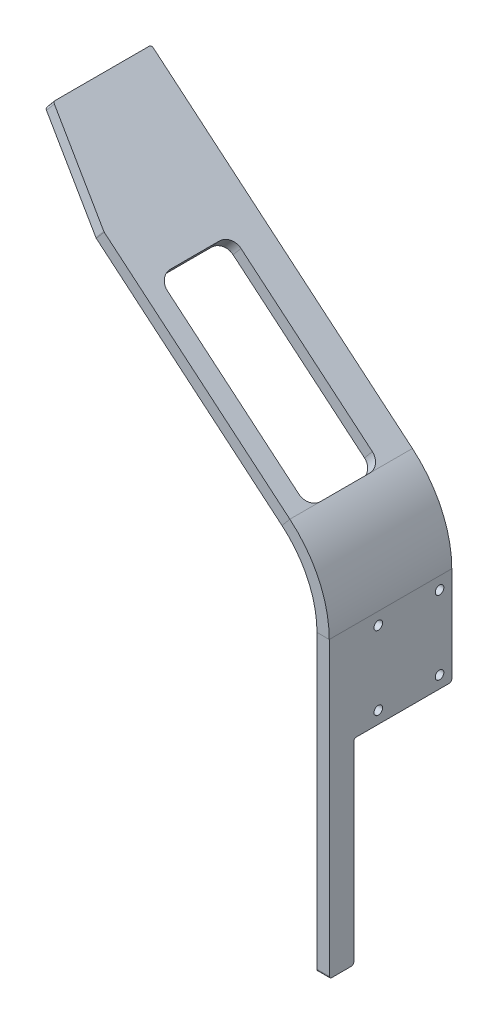
ISO-10303-21;
HEADER;
FILE_DESCRIPTION(('STEP AP214'),'2;1');
FILE_NAME('part.step','',(''),(''),'','','');
FILE_SCHEMA(('AUTOMOTIVE_DESIGN { 1 0 10303 214 1 1 1 1 }'));
ENDSEC;
DATA;
#1=APPLICATION_CONTEXT('core data for automotive mechanical design processes');
#2=APPLICATION_PROTOCOL_DEFINITION('international standard','automotive_design',2000,#1);
#3=PRODUCT_CONTEXT('',#1,'mechanical');
#4=PRODUCT('Part','Part','',(#3));
#5=PRODUCT_RELATED_PRODUCT_CATEGORY('part','',(#4));
#6=PRODUCT_DEFINITION_FORMATION('','',#4);
#7=PRODUCT_DEFINITION_CONTEXT('part definition',#1,'design');
#8=PRODUCT_DEFINITION('design','',#6,#7);
#9=PRODUCT_DEFINITION_SHAPE('','',#8);
#10=(LENGTH_UNIT() NAMED_UNIT(*) SI_UNIT(.MILLI.,.METRE.));
#11=(NAMED_UNIT(*) PLANE_ANGLE_UNIT() SI_UNIT($,.RADIAN.));
#12=(NAMED_UNIT(*) SI_UNIT($,.STERADIAN.) SOLID_ANGLE_UNIT());
#13=UNCERTAINTY_MEASURE_WITH_UNIT(LENGTH_MEASURE(1.E-05),#10,'distance_accuracy_value','');
#14=(GEOMETRIC_REPRESENTATION_CONTEXT(3) GLOBAL_UNCERTAINTY_ASSIGNED_CONTEXT((#13)) GLOBAL_UNIT_ASSIGNED_CONTEXT((#10,
#11,#12)) REPRESENTATION_CONTEXT('',''));
#15=CARTESIAN_POINT('',(0.,0.,0.));
#16=DIRECTION('',(0.,0.,1.));
#17=DIRECTION('',(1.,0.,0.));
#18=AXIS2_PLACEMENT_3D('',#15,#16,#17);
#19=CARTESIAN_POINT('',(5.,0.,50.));
#20=DIRECTION('',(-1.,0.,0.));
#21=DIRECTION('',(0.,0.,1.));
#22=AXIS2_PLACEMENT_3D('',#19,#20,#21);
#23=PLANE('',#22);
#24=CARTESIAN_POINT('',(5.,145.,30.));
#25=DIRECTION('',(-1.,0.,0.));
#26=DIRECTION('',(0.,0.,1.));
#27=AXIS2_PLACEMENT_3D('',#24,#25,#26);
#28=CIRCLE('',#27,1.75000000000001);
#29=CARTESIAN_POINT('',(5.,145.,31.75));
#30=VERTEX_POINT('',#29);
#31=EDGE_CURVE('E497',#30,#30,#28,.T.);
#32=ORIENTED_EDGE('',*,*,#31,.T.);
#33=EDGE_LOOP('',(#32));
#34=FACE_BOUND('',#33,.T.);
#35=CARTESIAN_POINT('',(5.,145.,5.));
#36=DIRECTION('',(-1.,0.,0.));
#37=DIRECTION('',(0.,0.,1.));
#38=AXIS2_PLACEMENT_3D('',#35,#36,#37);
#39=CIRCLE('',#38,1.75);
#40=CARTESIAN_POINT('',(5.,145.,6.75));
#41=VERTEX_POINT('',#40);
#42=EDGE_CURVE('E494',#41,#41,#39,.T.);
#43=ORIENTED_EDGE('',*,*,#42,.T.);
#44=EDGE_LOOP('',(#43));
#45=FACE_BOUND('',#44,.T.);
#46=CARTESIAN_POINT('',(5.,115.,5.));
#47=DIRECTION('',(-1.,0.,0.));
#48=DIRECTION('',(0.,0.,1.));
#49=AXIS2_PLACEMENT_3D('',#46,#47,#48);
#50=CIRCLE('',#49,1.75);
#51=CARTESIAN_POINT('',(5.,115.,6.75));
#52=VERTEX_POINT('',#51);
#53=EDGE_CURVE('E491',#52,#52,#50,.T.);
#54=ORIENTED_EDGE('',*,*,#53,.T.);
#55=EDGE_LOOP('',(#54));
#56=FACE_BOUND('',#55,.T.);
#57=CARTESIAN_POINT('',(5.,115.,30.));
#58=DIRECTION('',(-1.,0.,0.));
#59=DIRECTION('',(0.,0.,1.));
#60=AXIS2_PLACEMENT_3D('',#57,#58,#59);
#61=CIRCLE('',#60,1.75000000000001);
#62=CARTESIAN_POINT('',(5.,115.,31.75));
#63=VERTEX_POINT('',#62);
#64=EDGE_CURVE('E488',#63,#63,#61,.T.);
#65=ORIENTED_EDGE('',*,*,#64,.T.);
#66=EDGE_LOOP('',(#65));
#67=FACE_BOUND('',#66,.T.);
#68=DIRECTION('',(0.,0.,1.));
#69=VECTOR('',#68,1.);
#70=CARTESIAN_POINT('',(5.,110.,0.));
#71=LINE('',#70,#69);
#72=CARTESIAN_POINT('',(5.,110.,1.));
#73=VERTEX_POINT('',#72);
#74=CARTESIAN_POINT('',(5.,110.,39.));
#75=VERTEX_POINT('',#74);
#76=EDGE_CURVE('E500',#73,#75,#71,.T.);
#77=ORIENTED_EDGE('',*,*,#76,.F.);
#78=CARTESIAN_POINT('',(5.,111.,1.));
#79=DIRECTION('',(-1.,0.,0.));
#80=DIRECTION('',(0.,0.,1.));
#81=AXIS2_PLACEMENT_3D('',#78,#79,#80);
#82=CIRCLE('',#81,1.);
#83=CARTESIAN_POINT('',(5.,111.,0.));
#84=VERTEX_POINT('',#83);
#85=EDGE_CURVE('E349',#73,#84,#82,.F.);
#86=ORIENTED_EDGE('',*,*,#85,.T.);
#87=DIRECTION('',(0.,1.,0.));
#88=VECTOR('',#87,1.);
#89=CARTESIAN_POINT('',(5.,0.,0.));
#90=LINE('',#89,#88);
#91=CARTESIAN_POINT('',(5.00000000000003,150.,0.));
#92=VERTEX_POINT('',#91);
#93=EDGE_CURVE('E313',#84,#92,#90,.T.);
#94=ORIENTED_EDGE('',*,*,#93,.T.);
#95=DIRECTION('',(0.,0.,-1.));
#96=VECTOR('',#95,1.);
#97=CARTESIAN_POINT('',(5.,150.,50.));
#98=LINE('',#97,#96);
#99=CARTESIAN_POINT('',(5.,150.,50.));
#100=VERTEX_POINT('',#99);
#101=EDGE_CURVE('E265',#100,#92,#98,.T.);
#102=ORIENTED_EDGE('',*,*,#101,.F.);
#103=DIRECTION('',(0.,1.,0.));
#104=VECTOR('',#103,1.);
#105=CARTESIAN_POINT('',(5.,0.,50.));
#106=LINE('',#105,#104);
#107=CARTESIAN_POINT('',(5.,31.,50.));
#108=VERTEX_POINT('',#107);
#109=EDGE_CURVE('E317',#108,#100,#106,.T.);
#110=ORIENTED_EDGE('',*,*,#109,.F.);
#111=CARTESIAN_POINT('',(5.,31.,49.));
#112=DIRECTION('',(-1.,0.,0.));
#113=DIRECTION('',(0.,0.,1.));
#114=AXIS2_PLACEMENT_3D('',#111,#112,#113);
#115=CIRCLE('',#114,1.);
#116=CARTESIAN_POINT('',(5.,30.,49.));
#117=VERTEX_POINT('',#116);
#118=EDGE_CURVE('E345',#108,#117,#115,.F.);
#119=ORIENTED_EDGE('',*,*,#118,.T.);
#120=DIRECTION('',(0.,0.,-1.));
#121=VECTOR('',#120,1.);
#122=CARTESIAN_POINT('',(5.,30.,50.));
#123=LINE('',#122,#121);
#124=CARTESIAN_POINT('',(5.,30.,41.));
#125=VERTEX_POINT('',#124);
#126=EDGE_CURVE('E473',#117,#125,#123,.T.);
#127=ORIENTED_EDGE('',*,*,#126,.T.);
#128=CARTESIAN_POINT('',(5.,31.,41.));
#129=DIRECTION('',(-1.,0.,0.));
#130=DIRECTION('',(0.,0.,1.));
#131=AXIS2_PLACEMENT_3D('',#128,#129,#130);
#132=CIRCLE('',#131,1.);
#133=CARTESIAN_POINT('',(5.,31.,40.));
#134=VERTEX_POINT('',#133);
#135=EDGE_CURVE('E347',#125,#134,#132,.F.);
#136=ORIENTED_EDGE('',*,*,#135,.T.);
#137=DIRECTION('',(0.,-1.,0.));
#138=VECTOR('',#137,1.);
#139=CARTESIAN_POINT('',(5.,110.,40.));
#140=LINE('',#139,#138);
#141=CARTESIAN_POINT('',(5.,109.,40.));
#142=VERTEX_POINT('',#141);
#143=EDGE_CURVE('E503',#142,#134,#140,.T.);
#144=ORIENTED_EDGE('',*,*,#143,.F.);
#145=CARTESIAN_POINT('',(5.,109.,39.));
#146=DIRECTION('',(-1.,0.,0.));
#147=DIRECTION('',(0.,0.,1.));
#148=AXIS2_PLACEMENT_3D('',#145,#146,#147);
#149=CIRCLE('',#148,1.);
#150=EDGE_CURVE('E398',#142,#75,#149,.T.);
#151=ORIENTED_EDGE('',*,*,#150,.T.);
#152=EDGE_LOOP('',(#77,#86,#94,#102,#110,#119,#127,#136,#144,#151));
#153=FACE_BOUND('',#152,.T.);
#154=ADVANCED_FACE('F70',(#34,#45,#56,#67,#153),#23,.F.);
#155=CARTESIAN_POINT('',(0.,0.,50.));
#156=DIRECTION('',(-1.,0.,0.));
#157=DIRECTION('',(0.,0.,1.));
#158=AXIS2_PLACEMENT_3D('',#155,#156,#157);
#159=PLANE('',#158);
#160=DIRECTION('',(0.,1.,0.));
#161=VECTOR('',#160,1.);
#162=CARTESIAN_POINT('',(0.,0.,0.));
#163=LINE('',#162,#161);
#164=CARTESIAN_POINT('',(0.,111.,0.));
#165=VERTEX_POINT('',#164);
#166=CARTESIAN_POINT('',(0.,150.,0.));
#167=VERTEX_POINT('',#166);
#168=EDGE_CURVE('E320',#165,#167,#163,.T.);
#169=ORIENTED_EDGE('',*,*,#168,.F.);
#170=CARTESIAN_POINT('',(0.,111.,1.));
#171=DIRECTION('',(-1.,0.,0.));
#172=DIRECTION('',(0.,0.,1.));
#173=AXIS2_PLACEMENT_3D('',#170,#171,#172);
#174=CIRCLE('',#173,1.);
#175=CARTESIAN_POINT('',(0.,110.,1.));
#176=VERTEX_POINT('',#175);
#177=EDGE_CURVE('E357',#165,#176,#174,.T.);
#178=ORIENTED_EDGE('',*,*,#177,.T.);
#179=DIRECTION('',(0.,0.,-1.));
#180=VECTOR('',#179,1.);
#181=CARTESIAN_POINT('',(0.,110.,50.));
#182=LINE('',#181,#180);
#183=CARTESIAN_POINT('',(0.,110.,39.));
#184=VERTEX_POINT('',#183);
#185=EDGE_CURVE('E506',#184,#176,#182,.T.);
#186=ORIENTED_EDGE('',*,*,#185,.F.);
#187=CARTESIAN_POINT('',(0.,109.,39.));
#188=DIRECTION('',(-1.,0.,0.));
#189=DIRECTION('',(0.,0.,1.));
#190=AXIS2_PLACEMENT_3D('',#187,#188,#189);
#191=CIRCLE('',#190,1.);
#192=CARTESIAN_POINT('',(0.,109.,40.));
#193=VERTEX_POINT('',#192);
#194=EDGE_CURVE('E400',#184,#193,#191,.F.);
#195=ORIENTED_EDGE('',*,*,#194,.T.);
#196=DIRECTION('',(0.,1.,0.));
#197=VECTOR('',#196,1.);
#198=CARTESIAN_POINT('',(0.,0.,40.));
#199=LINE('',#198,#197);
#200=CARTESIAN_POINT('',(0.,31.,40.));
#201=VERTEX_POINT('',#200);
#202=EDGE_CURVE('E311',#201,#193,#199,.T.);
#203=ORIENTED_EDGE('',*,*,#202,.F.);
#204=CARTESIAN_POINT('',(0.,31.,41.));
#205=DIRECTION('',(-1.,0.,0.));
#206=DIRECTION('',(0.,0.,1.));
#207=AXIS2_PLACEMENT_3D('',#204,#205,#206);
#208=CIRCLE('',#207,1.);
#209=CARTESIAN_POINT('',(0.,30.,41.));
#210=VERTEX_POINT('',#209);
#211=EDGE_CURVE('E355',#201,#210,#208,.T.);
#212=ORIENTED_EDGE('',*,*,#211,.T.);
#213=DIRECTION('',(0.,0.,-1.));
#214=VECTOR('',#213,1.);
#215=CARTESIAN_POINT('',(0.,30.,40.));
#216=LINE('',#215,#214);
#217=CARTESIAN_POINT('',(0.,30.,49.));
#218=VERTEX_POINT('',#217);
#219=EDGE_CURVE('E450',#218,#210,#216,.T.);
#220=ORIENTED_EDGE('',*,*,#219,.F.);
#221=CARTESIAN_POINT('',(0.,31.,49.));
#222=DIRECTION('',(-1.,0.,0.));
#223=DIRECTION('',(0.,0.,1.));
#224=AXIS2_PLACEMENT_3D('',#221,#222,#223);
#225=CIRCLE('',#224,1.);
#226=CARTESIAN_POINT('',(0.,31.,50.));
#227=VERTEX_POINT('',#226);
#228=EDGE_CURVE('E353',#218,#227,#225,.T.);
#229=ORIENTED_EDGE('',*,*,#228,.T.);
#230=DIRECTION('',(0.,1.,0.));
#231=VECTOR('',#230,1.);
#232=CARTESIAN_POINT('',(0.,0.,50.));
#233=LINE('',#232,#231);
#234=CARTESIAN_POINT('',(0.,150.,50.));
#235=VERTEX_POINT('',#234);
#236=EDGE_CURVE('E323',#227,#235,#233,.T.);
#237=ORIENTED_EDGE('',*,*,#236,.T.);
#238=DIRECTION('',(0.,0.,-1.));
#239=VECTOR('',#238,1.);
#240=CARTESIAN_POINT('',(0.,150.,50.));
#241=LINE('',#240,#239);
#242=EDGE_CURVE('E325',#235,#167,#241,.T.);
#243=ORIENTED_EDGE('',*,*,#242,.T.);
#244=EDGE_LOOP('',(#169,#178,#186,#195,#203,#212,#220,#229,#237,#243));
#245=FACE_BOUND('',#244,.T.);
#246=CARTESIAN_POINT('',(0.,145.,30.));
#247=DIRECTION('',(-1.,0.,0.));
#248=DIRECTION('',(0.,0.,1.));
#249=AXIS2_PLACEMENT_3D('',#246,#247,#248);
#250=CIRCLE('',#249,1.75000000000001);
#251=CARTESIAN_POINT('',(0.,145.,31.75));
#252=VERTEX_POINT('',#251);
#253=EDGE_CURVE('E476',#252,#252,#250,.T.);
#254=ORIENTED_EDGE('',*,*,#253,.F.);
#255=EDGE_LOOP('',(#254));
#256=FACE_BOUND('',#255,.T.);
#257=CARTESIAN_POINT('',(0.,145.,5.));
#258=DIRECTION('',(-1.,0.,0.));
#259=DIRECTION('',(0.,0.,1.));
#260=AXIS2_PLACEMENT_3D('',#257,#258,#259);
#261=CIRCLE('',#260,1.75);
#262=CARTESIAN_POINT('',(0.,145.,6.75));
#263=VERTEX_POINT('',#262);
#264=EDGE_CURVE('E481',#263,#263,#261,.T.);
#265=ORIENTED_EDGE('',*,*,#264,.F.);
#266=EDGE_LOOP('',(#265));
#267=FACE_BOUND('',#266,.T.);
#268=CARTESIAN_POINT('',(0.,115.,5.));
#269=DIRECTION('',(-1.,0.,0.));
#270=DIRECTION('',(0.,0.,1.));
#271=AXIS2_PLACEMENT_3D('',#268,#269,#270);
#272=CIRCLE('',#271,1.75);
#273=CARTESIAN_POINT('',(0.,115.,6.75));
#274=VERTEX_POINT('',#273);
#275=EDGE_CURVE('E477',#274,#274,#272,.T.);
#276=ORIENTED_EDGE('',*,*,#275,.F.);
#277=EDGE_LOOP('',(#276));
#278=FACE_BOUND('',#277,.T.);
#279=CARTESIAN_POINT('',(0.,115.,30.));
#280=DIRECTION('',(-1.,0.,0.));
#281=DIRECTION('',(0.,0.,1.));
#282=AXIS2_PLACEMENT_3D('',#279,#280,#281);
#283=CIRCLE('',#282,1.75000000000001);
#284=CARTESIAN_POINT('',(0.,115.,31.75));
#285=VERTEX_POINT('',#284);
#286=EDGE_CURVE('E480',#285,#285,#283,.T.);
#287=ORIENTED_EDGE('',*,*,#286,.F.);
#288=EDGE_LOOP('',(#287));
#289=FACE_BOUND('',#288,.T.);
#290=ADVANCED_FACE('F555',(#245,#256,#267,#278,#289),#159,.T.);
#291=CARTESIAN_POINT('',(0.,0.,50.));
#292=DIRECTION('',(0.,0.,-1.));
#293=DIRECTION('',(-1.,0.,0.));
#294=AXIS2_PLACEMENT_3D('',#291,#292,#293);
#295=PLANE('',#294);
#296=ORIENTED_EDGE('',*,*,#236,.F.);
#297=DIRECTION('',(-1.,0.,0.));
#298=VECTOR('',#297,1.);
#299=CARTESIAN_POINT('',(0.,31.,50.));
#300=LINE('',#299,#298);
#301=EDGE_CURVE('E370',#227,#108,#300,.F.);
#302=ORIENTED_EDGE('',*,*,#301,.T.);
#303=ORIENTED_EDGE('',*,*,#109,.T.);
#304=DIRECTION('',(1.,0.,0.));
#305=VECTOR('',#304,1.);
#306=CARTESIAN_POINT('',(0.,150.,50.));
#307=LINE('',#306,#305);
#308=EDGE_CURVE('E319',#235,#100,#307,.T.);
#309=ORIENTED_EDGE('',*,*,#308,.F.);
#310=EDGE_LOOP('',(#296,#302,#303,#309));
#311=FACE_BOUND('',#310,.T.);
#312=ADVANCED_FACE('F561',(#311),#295,.F.);
#313=CARTESIAN_POINT('',(0.,0.,0.));
#314=DIRECTION('',(0.,0.,-1.));
#315=DIRECTION('',(-1.,0.,0.));
#316=AXIS2_PLACEMENT_3D('',#313,#314,#315);
#317=PLANE('',#316);
#318=ORIENTED_EDGE('',*,*,#93,.F.);
#319=DIRECTION('',(1.,0.,0.));
#320=VECTOR('',#319,1.);
#321=CARTESIAN_POINT('',(0.,111.,0.));
#322=LINE('',#321,#320);
#323=EDGE_CURVE('E351',#84,#165,#322,.F.);
#324=ORIENTED_EDGE('',*,*,#323,.T.);
#325=ORIENTED_EDGE('',*,*,#168,.T.);
#326=DIRECTION('',(1.,0.,0.));
#327=VECTOR('',#326,1.);
#328=CARTESIAN_POINT('',(0.,150.,0.));
#329=LINE('',#328,#327);
#330=EDGE_CURVE('E327',#167,#92,#329,.T.);
#331=ORIENTED_EDGE('',*,*,#330,.T.);
#332=EDGE_LOOP('',(#318,#324,#325,#331));
#333=FACE_BOUND('',#332,.T.);
#334=ADVANCED_FACE('F532',(#333),#317,.T.);
#335=CARTESIAN_POINT('',(-40.,150.,50.));
#336=DIRECTION('',(0.,0.,1.));
#337=DIRECTION('',(1.,0.,0.));
#338=AXIS2_PLACEMENT_3D('',#335,#336,#337);
#339=PLANE('',#338);
#340=DIRECTION('',(-0.642787609686543,-0.766044443118975,0.));
#341=VECTOR('',#340,1.);
#342=CARTESIAN_POINT('',(-11.0745575641056,184.471999940354,50.));
#343=LINE('',#342,#341);
#344=CARTESIAN_POINT('',(-14.2884956125382,180.641777724759,50.));
#345=VERTEX_POINT('',#344);
#346=CARTESIAN_POINT('',(-11.0745575641055,184.471999940354,50.));
#347=VERTEX_POINT('',#346);
#348=EDGE_CURVE('E308',#345,#347,#343,.F.);
#349=ORIENTED_EDGE('',*,*,#348,.F.);
#350=CARTESIAN_POINT('',(-40.,150.,50.));
#351=DIRECTION('',(0.,0.,-1.));
#352=DIRECTION('',(-1.,0.,0.));
#353=AXIS2_PLACEMENT_3D('',#350,#351,#352);
#354=CIRCLE('',#353,40.0000000000001);
#355=EDGE_CURVE('E269',#235,#345,#354,.F.);
#356=ORIENTED_EDGE('',*,*,#355,.F.);
#357=ORIENTED_EDGE('',*,*,#308,.T.);
#358=CARTESIAN_POINT('',(-40.,150.,50.));
#359=DIRECTION('',(0.,0.,-1.));
#360=DIRECTION('',(-1.,0.,0.));
#361=AXIS2_PLACEMENT_3D('',#358,#359,#360);
#362=CIRCLE('',#361,45.0000000000001);
#363=EDGE_CURVE('E268',#100,#347,#362,.F.);
#364=ORIENTED_EDGE('',*,*,#363,.T.);
#365=EDGE_LOOP('',(#349,#356,#357,#364));
#366=FACE_BOUND('',#365,.T.);
#367=ADVANCED_FACE('F617',(#366),#339,.T.);
#368=CARTESIAN_POINT('',(-40.,150.,0.));
#369=DIRECTION('',(0.,0.,1.));
#370=DIRECTION('',(1.,0.,0.));
#371=AXIS2_PLACEMENT_3D('',#368,#369,#370);
#372=PLANE('',#371);
#373=CARTESIAN_POINT('',(-40.,150.,0.));
#374=DIRECTION('',(0.,0.,-1.));
#375=DIRECTION('',(-1.,0.,0.));
#376=AXIS2_PLACEMENT_3D('',#373,#374,#375);
#377=CIRCLE('',#376,40.0000000000001);
#378=CARTESIAN_POINT('',(-14.2884956125382,180.641777724759,0.));
#379=VERTEX_POINT('',#378);
#380=EDGE_CURVE('E276',#379,#167,#377,.T.);
#381=ORIENTED_EDGE('',*,*,#380,.F.);
#382=DIRECTION('',(-0.642787609686543,-0.766044443118975,0.));
#383=VECTOR('',#382,1.);
#384=CARTESIAN_POINT('',(-14.2884956125383,180.641777724759,0.));
#385=LINE('',#384,#383);
#386=CARTESIAN_POINT('',(-11.0745575641055,184.471999940354,0.));
#387=VERTEX_POINT('',#386);
#388=EDGE_CURVE('E273',#379,#387,#385,.F.);
#389=ORIENTED_EDGE('',*,*,#388,.T.);
#390=CARTESIAN_POINT('',(-40.,150.,0.));
#391=DIRECTION('',(0.,0.,-1.));
#392=DIRECTION('',(-1.,0.,0.));
#393=AXIS2_PLACEMENT_3D('',#390,#391,#392);
#394=CIRCLE('',#393,45.0000000000001);
#395=EDGE_CURVE('E260',#387,#92,#394,.T.);
#396=ORIENTED_EDGE('',*,*,#395,.T.);
#397=ORIENTED_EDGE('',*,*,#330,.F.);
#398=EDGE_LOOP('',(#381,#389,#396,#397));
#399=FACE_BOUND('',#398,.T.);
#400=ADVANCED_FACE('F274',(#399),#372,.F.);
#401=CARTESIAN_POINT('',(-40.,150.,0.));
#402=DIRECTION('',(0.,0.,-1.));
#403=DIRECTION('',(0.642787609686543,0.766044443118975,0.));
#404=AXIS2_PLACEMENT_3D('',#401,#402,#403);
#405=CYLINDRICAL_SURFACE('',#404,45.0000000000001);
#406=ORIENTED_EDGE('',*,*,#101,.T.);
#407=ORIENTED_EDGE('',*,*,#395,.F.);
#408=DIRECTION('',(0.,0.,-1.));
#409=VECTOR('',#408,1.);
#410=CARTESIAN_POINT('',(-11.0745575641055,184.471999940354,50.));
#411=LINE('',#410,#409);
#412=CARTESIAN_POINT('',(-11.0745575641055,184.471999940354,17.5));
#413=VERTEX_POINT('',#412);
#414=EDGE_CURVE('E94',#387,#413,#411,.F.);
#415=ORIENTED_EDGE('',*,*,#414,.T.);
#416=DIRECTION('',(0.,0.,-1.));
#417=VECTOR('',#416,1.);
#418=CARTESIAN_POINT('',(-11.0745575641055,184.471999940354,42.5));
#419=LINE('',#418,#417);
#420=CARTESIAN_POINT('',(-11.0745575641055,184.471999940354,37.5));
#421=VERTEX_POINT('',#420);
#422=EDGE_CURVE('E467',#421,#413,#419,.T.);
#423=ORIENTED_EDGE('',*,*,#422,.F.);
#424=EDGE_CURVE('E280',#421,#347,#411,.F.);
#425=ORIENTED_EDGE('',*,*,#424,.T.);
#426=ORIENTED_EDGE('',*,*,#363,.F.);
#427=EDGE_LOOP('',(#406,#407,#415,#423,#425,#426));
#428=FACE_BOUND('',#427,.T.);
#429=ADVANCED_FACE('F262',(#428),#405,.T.);
#430=CARTESIAN_POINT('',(-40.,150.,0.));
#431=DIRECTION('',(0.,0.,-1.));
#432=DIRECTION('',(0.642787609686543,0.766044443118975,0.));
#433=AXIS2_PLACEMENT_3D('',#430,#431,#432);
#434=CYLINDRICAL_SURFACE('',#433,40.0000000000001);
#435=ORIENTED_EDGE('',*,*,#242,.F.);
#436=ORIENTED_EDGE('',*,*,#355,.T.);
#437=DIRECTION('',(0.,0.,-1.));
#438=VECTOR('',#437,1.);
#439=CARTESIAN_POINT('',(-14.2884956125383,180.641777724759,50.));
#440=LINE('',#439,#438);
#441=CARTESIAN_POINT('',(-14.2884956125383,180.641777724759,37.5));
#442=VERTEX_POINT('',#441);
#443=EDGE_CURVE('E85',#345,#442,#440,.T.);
#444=ORIENTED_EDGE('',*,*,#443,.T.);
#445=CARTESIAN_POINT('',(-14.2884956125383,180.641777724759,17.5));
#446=VERTEX_POINT('',#445);
#447=EDGE_CURVE('E307',#442,#446,#440,.T.);
#448=ORIENTED_EDGE('',*,*,#447,.T.);
#449=EDGE_CURVE('E107',#446,#379,#440,.T.);
#450=ORIENTED_EDGE('',*,*,#449,.T.);
#451=ORIENTED_EDGE('',*,*,#380,.T.);
#452=EDGE_LOOP('',(#435,#436,#444,#448,#450,#451));
#453=FACE_BOUND('',#452,.T.);
#454=ADVANCED_FACE('F535',(#453),#434,.F.);
#455=CARTESIAN_POINT('',(3.21393804843272,172.482528541795,50.));
#456=DIRECTION('',(0.,0.,-1.));
#457=DIRECTION('',(-1.,0.,0.));
#458=AXIS2_PLACEMENT_3D('',#455,#456,#457);
#459=PLANE('',#458);
#460=DIRECTION('',(0.766044443118975,-0.642787609686543,0.));
#461=VECTOR('',#460,1.);
#462=CARTESIAN_POINT('',(77.0745195243485,110.506141866814,50.));
#463=LINE('',#462,#461);
#464=CARTESIAN_POINT('',(-86.8310287938553,248.03922700853,50.));
#465=VERTEX_POINT('',#464);
#466=EDGE_CURVE('E292',#465,#347,#463,.T.);
#467=ORIENTED_EDGE('',*,*,#466,.F.);
#468=DIRECTION('',(0.642787609686543,0.766044443118975,0.));
#469=VECTOR('',#468,1.);
#470=CARTESIAN_POINT('',(-90.0449668422881,244.209004792935,50.));
#471=LINE('',#470,#469);
#472=CARTESIAN_POINT('',(-90.044966842288,244.209004792935,50.));
#473=VERTEX_POINT('',#472);
#474=EDGE_CURVE('E372',#465,#473,#471,.F.);
#475=ORIENTED_EDGE('',*,*,#474,.T.);
#476=DIRECTION('',(-0.766044443118975,0.642787609686543,0.));
#477=VECTOR('',#476,1.);
#478=CARTESIAN_POINT('',(0.,168.6523063262,50.));
#479=LINE('',#478,#477);
#480=EDGE_CURVE('E286',#473,#345,#479,.F.);
#481=ORIENTED_EDGE('',*,*,#480,.T.);
#482=ORIENTED_EDGE('',*,*,#348,.T.);
#483=EDGE_LOOP('',(#467,#475,#481,#482));
#484=FACE_BOUND('',#483,.T.);
#485=ADVANCED_FACE('F614',(#484),#459,.F.);
#486=CARTESIAN_POINT('',(-117.567110899036,273.829862166822,0.));
#487=DIRECTION('',(0.,0.,1.));
#488=DIRECTION('',(1.,0.,0.));
#489=AXIS2_PLACEMENT_3D('',#486,#487,#488);
#490=PLANE('',#489);
#491=DIRECTION('',(0.766044443118975,-0.642787609686543,0.));
#492=VECTOR('',#491,1.);
#493=CARTESIAN_POINT('',(-120.781048947469,269.999639951227,0.));
#494=LINE('',#493,#492);
#495=CARTESIAN_POINT('',(-120.01500450435,269.35685234154,0.));
#496=VERTEX_POINT('',#495);
#497=EDGE_CURVE('E303',#379,#496,#494,.F.);
#498=ORIENTED_EDGE('',*,*,#497,.T.);
#499=DIRECTION('',(-0.642787609686543,-0.766044443118975,0.));
#500=VECTOR('',#499,1.);
#501=CARTESIAN_POINT('',(-116.801066455917,273.187074557135,0.));
#502=LINE('',#501,#500);
#503=CARTESIAN_POINT('',(-116.801066455917,273.187074557135,0.));
#504=VERTEX_POINT('',#503);
#505=EDGE_CURVE('E290',#496,#504,#502,.F.);
#506=ORIENTED_EDGE('',*,*,#505,.T.);
#507=DIRECTION('',(-0.766044443118975,0.642787609686543,0.));
#508=VECTOR('',#507,1.);
#509=CARTESIAN_POINT('',(77.0745195243485,110.506141866814,0.));
#510=LINE('',#509,#508);
#511=EDGE_CURVE('E284',#387,#504,#510,.T.);
#512=ORIENTED_EDGE('',*,*,#511,.F.);
#513=ORIENTED_EDGE('',*,*,#388,.F.);
#514=EDGE_LOOP('',(#498,#506,#512,#513));
#515=FACE_BOUND('',#514,.T.);
#516=ADVANCED_FACE('F288',(#515),#490,.F.);
#517=CARTESIAN_POINT('',(77.0745195243485,110.506141866814,0.));
#518=DIRECTION('',(-0.642787609686543,-0.766044443118975,0.));
#519=DIRECTION('',(0.766044443118975,-0.642787609686543,0.));
#520=AXIS2_PLACEMENT_3D('',#517,#518,#519);
#521=PLANE('',#520);
#522=ORIENTED_EDGE('',*,*,#424,.F.);
#523=CARTESIAN_POINT('',(-14.9047797797004,187.685937988787,37.5));
#524=DIRECTION('',(-0.642787609686543,-0.766044443118975,0.));
#525=DIRECTION('',(0.766044443118975,-0.642787609686543,0.));
#526=AXIS2_PLACEMENT_3D('',#523,#524,#525);
#527=CIRCLE('',#526,5.);
#528=CARTESIAN_POINT('',(-14.9047797797004,187.685937988787,42.5));
#529=VERTEX_POINT('',#528);
#530=EDGE_CURVE('E78',#421,#529,#527,.T.);
#531=ORIENTED_EDGE('',*,*,#530,.T.);
#532=DIRECTION('',(0.766044443118974,-0.642787609686544,0.));
#533=VECTOR('',#532,1.);
#534=CARTESIAN_POINT('',(-11.0745575641055,184.471999940354,42.5));
#535=LINE('',#534,#533);
#536=CARTESIAN_POINT('',(-68.5278907980286,232.681070666845,42.5));
#537=VERTEX_POINT('',#536);
#538=EDGE_CURVE('E442',#537,#529,#535,.T.);
#539=ORIENTED_EDGE('',*,*,#538,.F.);
#540=CARTESIAN_POINT('',(-68.5278907980287,232.681070666845,37.5));
#541=DIRECTION('',(-0.642787609686543,-0.766044443118975,0.));
#542=DIRECTION('',(0.766044443118975,-0.642787609686543,0.));
#543=AXIS2_PLACEMENT_3D('',#540,#541,#542);
#544=CIRCLE('',#543,5.);
#545=CARTESIAN_POINT('',(-72.3581130136234,235.895008715278,37.5));
#546=VERTEX_POINT('',#545);
#547=EDGE_CURVE('E430',#537,#546,#544,.T.);
#548=ORIENTED_EDGE('',*,*,#547,.T.);
#549=DIRECTION('',(0.,0.,1.));
#550=VECTOR('',#549,1.);
#551=CARTESIAN_POINT('',(-72.3581130136234,235.895008715278,42.5));
#552=LINE('',#551,#550);
#553=CARTESIAN_POINT('',(-72.3581130136234,235.895008715278,17.5));
#554=VERTEX_POINT('',#553);
#555=EDGE_CURVE('E451',#554,#546,#552,.T.);
#556=ORIENTED_EDGE('',*,*,#555,.F.);
#557=CARTESIAN_POINT('',(-68.5278907980287,232.681070666845,17.5));
#558=DIRECTION('',(-0.642787609686543,-0.766044443118975,0.));
#559=DIRECTION('',(0.766044443118975,-0.642787609686543,0.));
#560=AXIS2_PLACEMENT_3D('',#557,#558,#559);
#561=CIRCLE('',#560,5.);
#562=CARTESIAN_POINT('',(-68.5278907980286,232.681070666845,12.5));
#563=VERTEX_POINT('',#562);
#564=EDGE_CURVE('E115',#554,#563,#561,.T.);
#565=ORIENTED_EDGE('',*,*,#564,.T.);
#566=DIRECTION('',(-0.766044443118974,0.642787609686544,0.));
#567=VECTOR('',#566,1.);
#568=CARTESIAN_POINT('',(-11.0745575641055,184.471999940354,12.5));
#569=LINE('',#568,#567);
#570=CARTESIAN_POINT('',(-14.9047797797004,187.685937988787,12.5));
#571=VERTEX_POINT('',#570);
#572=EDGE_CURVE('E465',#571,#563,#569,.T.);
#573=ORIENTED_EDGE('',*,*,#572,.F.);
#574=CARTESIAN_POINT('',(-14.9047797797004,187.685937988787,17.5));
#575=DIRECTION('',(-0.642787609686543,-0.766044443118975,0.));
#576=DIRECTION('',(0.766044443118975,-0.642787609686543,0.));
#577=AXIS2_PLACEMENT_3D('',#574,#575,#576);
#578=CIRCLE('',#577,5.);
#579=EDGE_CURVE('E123',#571,#413,#578,.T.);
#580=ORIENTED_EDGE('',*,*,#579,.T.);
#581=ORIENTED_EDGE('',*,*,#414,.F.);
#582=ORIENTED_EDGE('',*,*,#511,.T.);
#583=CARTESIAN_POINT('',(-116.801066455917,273.187074557135,1.));
#584=DIRECTION('',(-0.642787609686543,-0.766044443118975,0.));
#585=DIRECTION('',(0.766044443118975,-0.642787609686543,0.));
#586=AXIS2_PLACEMENT_3D('',#583,#584,#585);
#587=CIRCLE('',#586,1.);
#588=CARTESIAN_POINT('',(-117.567110899036,273.829862166822,1.));
#589=VERTEX_POINT('',#588);
#590=EDGE_CURVE('E387',#504,#589,#587,.F.);
#591=ORIENTED_EDGE('',*,*,#590,.T.);
#592=DIRECTION('',(0.,0.,1.));
#593=VECTOR('',#592,1.);
#594=CARTESIAN_POINT('',(-117.567110899036,273.829862166822,0.));
#595=LINE('',#594,#593);
#596=CARTESIAN_POINT('',(-117.567110899036,273.829862166822,39.2192235935956));
#597=VERTEX_POINT('',#596);
#598=EDGE_CURVE('E291',#589,#597,#595,.T.);
#599=ORIENTED_EDGE('',*,*,#598,.T.);
#600=CARTESIAN_POINT('',(-116.801066455917,273.187074557135,39.2192235935956));
#601=DIRECTION('',(-0.642787609686543,-0.766044443118975,0.));
#602=DIRECTION('',(0.766044443118975,-0.642787609686543,0.));
#603=AXIS2_PLACEMENT_3D('',#600,#601,#602);
#604=CIRCLE('',#603,1.);
#605=CARTESIAN_POINT('',(-116.986859523734,273.342973451816,40.1893660937409));
#606=VERTEX_POINT('',#605);
#607=EDGE_CURVE('E385',#597,#606,#604,.F.);
#608=ORIENTED_EDGE('',*,*,#607,.T.);
#609=DIRECTION('',(-0.743172271269881,0.623595578723745,-0.24253562503633));
#610=VECTOR('',#609,1.);
#611=CARTESIAN_POINT('',(-86.9253331742764,248.11835777936,50.));
#612=LINE('',#611,#610);
#613=CARTESIAN_POINT('',(-87.0168218616728,248.195125903211,49.9701425001453));
#614=VERTEX_POINT('',#613);
#615=EDGE_CURVE('E337',#606,#614,#612,.F.);
#616=ORIENTED_EDGE('',*,*,#615,.T.);
#617=CARTESIAN_POINT('',(-86.8310287938554,248.03922700853,49.));
#618=DIRECTION('',(-0.642787609686543,-0.766044443118975,0.));
#619=DIRECTION('',(0.766044443118975,-0.642787609686543,0.));
#620=AXIS2_PLACEMENT_3D('',#617,#618,#619);
#621=CIRCLE('',#620,1.);
#622=EDGE_CURVE('E389',#614,#465,#621,.F.);
#623=ORIENTED_EDGE('',*,*,#622,.T.);
#624=ORIENTED_EDGE('',*,*,#466,.T.);
#625=EDGE_LOOP('',(#522,#531,#539,#548,#556,#565,#573,#580,#581,#582,#591,#599,#608,#616,#623,#624));
#626=FACE_BOUND('',#625,.T.);
#627=ADVANCED_FACE('F283',(#626),#521,.F.);
#628=CARTESIAN_POINT('',(73.8605814759158,106.675919651219,0.));
#629=DIRECTION('',(-0.642787609686543,-0.766044443118975,0.));
#630=DIRECTION('',(0.766044443118975,-0.642787609686543,0.));
#631=AXIS2_PLACEMENT_3D('',#628,#629,#630);
#632=PLANE('',#631);
#633=DIRECTION('',(-0.766044443118975,0.642787609686543,0.));
#634=VECTOR('',#633,1.);
#635=CARTESIAN_POINT('',(73.8605814759158,106.675919651219,42.5));
#636=LINE('',#635,#634);
#637=CARTESIAN_POINT('',(-18.1187178281332,183.855715773192,42.5));
#638=VERTEX_POINT('',#637);
#639=CARTESIAN_POINT('',(-71.7418288464614,228.85084845125,42.5));
#640=VERTEX_POINT('',#639);
#641=EDGE_CURVE('E408',#638,#640,#636,.T.);
#642=ORIENTED_EDGE('',*,*,#641,.F.);
#643=CARTESIAN_POINT('',(-18.1187178281332,183.855715773192,37.5));
#644=DIRECTION('',(-0.642787609686543,-0.766044443118975,0.));
#645=DIRECTION('',(0.766044443118975,-0.642787609686543,0.));
#646=AXIS2_PLACEMENT_3D('',#643,#644,#645);
#647=CIRCLE('',#646,5.);
#648=EDGE_CURVE('E15',#638,#442,#647,.F.);
#649=ORIENTED_EDGE('',*,*,#648,.T.);
#650=ORIENTED_EDGE('',*,*,#443,.F.);
#651=ORIENTED_EDGE('',*,*,#480,.F.);
#652=CARTESIAN_POINT('',(-90.0449668422881,244.209004792935,49.));
#653=DIRECTION('',(-0.642787609686543,-0.766044443118975,0.));
#654=DIRECTION('',(0.766044443118975,-0.642787609686543,0.));
#655=AXIS2_PLACEMENT_3D('',#652,#653,#654);
#656=CIRCLE('',#655,1.);
#657=CARTESIAN_POINT('',(-90.2307599101055,244.364903687616,49.9701425001453));
#658=VERTEX_POINT('',#657);
#659=EDGE_CURVE('E379',#473,#658,#656,.T.);
#660=ORIENTED_EDGE('',*,*,#659,.T.);
#661=DIRECTION('',(0.743172271269881,-0.623595578723745,0.24253562503633));
#662=VECTOR('',#661,1.);
#663=CARTESIAN_POINT('',(55.2012437510679,122.332963054151,97.4321419205185));
#664=LINE('',#663,#662);
#665=CARTESIAN_POINT('',(-120.200797572167,269.512751236221,40.1893660937409));
#666=VERTEX_POINT('',#665);
#667=EDGE_CURVE('E334',#658,#666,#664,.F.);
#668=ORIENTED_EDGE('',*,*,#667,.T.);
#669=CARTESIAN_POINT('',(-120.01500450435,269.35685234154,39.2192235935956));
#670=DIRECTION('',(-0.642787609686543,-0.766044443118975,0.));
#671=DIRECTION('',(0.766044443118975,-0.642787609686543,0.));
#672=AXIS2_PLACEMENT_3D('',#669,#670,#671);
#673=CIRCLE('',#672,1.);
#674=CARTESIAN_POINT('',(-120.781048947469,269.999639951227,39.2192235935956));
#675=VERTEX_POINT('',#674);
#676=EDGE_CURVE('E375',#666,#675,#673,.T.);
#677=ORIENTED_EDGE('',*,*,#676,.T.);
#678=DIRECTION('',(0.,0.,-1.));
#679=VECTOR('',#678,1.);
#680=CARTESIAN_POINT('',(-120.781048947469,269.999639951227,50.));
#681=LINE('',#680,#679);
#682=CARTESIAN_POINT('',(-120.781048947469,269.999639951227,1.));
#683=VERTEX_POINT('',#682);
#684=EDGE_CURVE('E297',#683,#675,#681,.F.);
#685=ORIENTED_EDGE('',*,*,#684,.F.);
#686=CARTESIAN_POINT('',(-120.01500450435,269.35685234154,1.));
#687=DIRECTION('',(-0.642787609686543,-0.766044443118975,0.));
#688=DIRECTION('',(0.766044443118975,-0.642787609686543,0.));
#689=AXIS2_PLACEMENT_3D('',#686,#687,#688);
#690=CIRCLE('',#689,1.);
#691=EDGE_CURVE('E377',#683,#496,#690,.T.);
#692=ORIENTED_EDGE('',*,*,#691,.T.);
#693=ORIENTED_EDGE('',*,*,#497,.F.);
#694=ORIENTED_EDGE('',*,*,#449,.F.);
#695=CARTESIAN_POINT('',(-18.1187178281332,183.855715773192,17.5));
#696=DIRECTION('',(-0.642787609686543,-0.766044443118975,0.));
#697=DIRECTION('',(0.766044443118975,-0.642787609686543,0.));
#698=AXIS2_PLACEMENT_3D('',#695,#696,#697);
#699=CIRCLE('',#698,5.);
#700=CARTESIAN_POINT('',(-18.1187178281332,183.855715773192,12.5));
#701=VERTEX_POINT('',#700);
#702=EDGE_CURVE('E438',#446,#701,#699,.F.);
#703=ORIENTED_EDGE('',*,*,#702,.T.);
#704=DIRECTION('',(0.766044443118975,-0.642787609686543,0.));
#705=VECTOR('',#704,1.);
#706=CARTESIAN_POINT('',(73.8605814759158,106.675919651219,12.5));
#707=LINE('',#706,#705);
#708=CARTESIAN_POINT('',(-71.7418288464614,228.85084845125,12.5));
#709=VERTEX_POINT('',#708);
#710=EDGE_CURVE('E402',#709,#701,#707,.T.);
#711=ORIENTED_EDGE('',*,*,#710,.F.);
#712=CARTESIAN_POINT('',(-71.7418288464614,228.85084845125,17.5));
#713=DIRECTION('',(-0.642787609686543,-0.766044443118975,0.));
#714=DIRECTION('',(0.766044443118975,-0.642787609686543,0.));
#715=AXIS2_PLACEMENT_3D('',#712,#713,#714);
#716=CIRCLE('',#715,5.);
#717=CARTESIAN_POINT('',(-75.5720510620562,232.064786499683,17.5));
#718=VERTEX_POINT('',#717);
#719=EDGE_CURVE('E435',#709,#718,#716,.F.);
#720=ORIENTED_EDGE('',*,*,#719,.T.);
#721=DIRECTION('',(0.,0.,-1.));
#722=VECTOR('',#721,1.);
#723=CARTESIAN_POINT('',(-75.5720510620562,232.064786499683,0.));
#724=LINE('',#723,#722);
#725=CARTESIAN_POINT('',(-75.5720510620562,232.064786499683,37.5));
#726=VERTEX_POINT('',#725);
#727=EDGE_CURVE('E405',#726,#718,#724,.T.);
#728=ORIENTED_EDGE('',*,*,#727,.F.);
#729=CARTESIAN_POINT('',(-71.7418288464614,228.85084845125,37.5));
#730=DIRECTION('',(-0.642787609686543,-0.766044443118975,0.));
#731=DIRECTION('',(0.766044443118975,-0.642787609686543,0.));
#732=AXIS2_PLACEMENT_3D('',#729,#730,#731);
#733=CIRCLE('',#732,5.);
#734=EDGE_CURVE('E432',#726,#640,#733,.F.);
#735=ORIENTED_EDGE('',*,*,#734,.T.);
#736=EDGE_LOOP('',(#642,#649,#650,#651,#660,#668,#677,#685,#692,#693,#694,#703,#711,#720,#728,#735));
#737=FACE_BOUND('',#736,.T.);
#738=ADVANCED_FACE('F454',(#737),#632,.T.);
#739=CARTESIAN_POINT('',(-117.567110899036,273.829862166822,50.));
#740=DIRECTION('',(0.766044443118975,-0.642787609686543,0.));
#741=DIRECTION('',(0.642787609686543,0.766044443118975,0.));
#742=AXIS2_PLACEMENT_3D('',#739,#740,#741);
#743=PLANE('',#742);
#744=ORIENTED_EDGE('',*,*,#598,.F.);
#745=DIRECTION('',(-0.642787609686543,-0.766044443118975,0.));
#746=VECTOR('',#745,1.);
#747=CARTESIAN_POINT('',(-117.567110899036,273.829862166822,1.));
#748=LINE('',#747,#746);
#749=EDGE_CURVE('E394',#589,#683,#748,.T.);
#750=ORIENTED_EDGE('',*,*,#749,.T.);
#751=ORIENTED_EDGE('',*,*,#684,.T.);
#752=DIRECTION('',(-0.642787609686543,-0.766044443118975,0.));
#753=VECTOR('',#752,1.);
#754=CARTESIAN_POINT('',(-117.567110899036,273.829862166822,39.2192235935956));
#755=LINE('',#754,#753);
#756=EDGE_CURVE('E391',#675,#597,#755,.F.);
#757=ORIENTED_EDGE('',*,*,#756,.T.);
#758=EDGE_LOOP('',(#744,#750,#751,#757));
#759=FACE_BOUND('',#758,.T.);
#760=ADVANCED_FACE('F606',(#759),#743,.F.);
#761=CARTESIAN_POINT('',(-5.,110.,40.));
#762=DIRECTION('',(0.,0.,1.));
#763=DIRECTION('',(0.,-1.,0.));
#764=AXIS2_PLACEMENT_3D('',#761,#762,#763);
#765=PLANE('',#764);
#766=ORIENTED_EDGE('',*,*,#202,.T.);
#767=DIRECTION('',(1.,0.,0.));
#768=VECTOR('',#767,1.);
#769=CARTESIAN_POINT('',(5.,109.,40.));
#770=LINE('',#769,#768);
#771=EDGE_CURVE('E362',#193,#142,#770,.T.);
#772=ORIENTED_EDGE('',*,*,#771,.T.);
#773=ORIENTED_EDGE('',*,*,#143,.T.);
#774=DIRECTION('',(-1.,0.,0.));
#775=VECTOR('',#774,1.);
#776=CARTESIAN_POINT('',(-5.,31.,40.));
#777=LINE('',#776,#775);
#778=EDGE_CURVE('E359',#134,#201,#777,.T.);
#779=ORIENTED_EDGE('',*,*,#778,.T.);
#780=EDGE_LOOP('',(#766,#772,#773,#779));
#781=FACE_BOUND('',#780,.T.);
#782=ADVANCED_FACE('F512',(#781),#765,.F.);
#783=CARTESIAN_POINT('',(-5.,110.,0.));
#784=DIRECTION('',(0.,1.,0.));
#785=DIRECTION('',(0.,0.,1.));
#786=AXIS2_PLACEMENT_3D('',#783,#784,#785);
#787=PLANE('',#786);
#788=ORIENTED_EDGE('',*,*,#185,.T.);
#789=DIRECTION('',(1.,0.,0.));
#790=VECTOR('',#789,1.);
#791=CARTESIAN_POINT('',(5.,110.,1.));
#792=LINE('',#791,#790);
#793=EDGE_CURVE('E342',#176,#73,#792,.T.);
#794=ORIENTED_EDGE('',*,*,#793,.T.);
#795=ORIENTED_EDGE('',*,*,#76,.T.);
#796=DIRECTION('',(1.,0.,0.));
#797=VECTOR('',#796,1.);
#798=CARTESIAN_POINT('',(0.,110.,39.));
#799=LINE('',#798,#797);
#800=EDGE_CURVE('E340',#75,#184,#799,.F.);
#801=ORIENTED_EDGE('',*,*,#800,.T.);
#802=EDGE_LOOP('',(#788,#794,#795,#801));
#803=FACE_BOUND('',#802,.T.);
#804=ADVANCED_FACE('F523',(#803),#787,.F.);
#805=CARTESIAN_POINT('',(10.,115.,30.));
#806=DIRECTION('',(-1.,0.,0.));
#807=DIRECTION('',(0.,0.,1.));
#808=AXIS2_PLACEMENT_3D('',#805,#806,#807);
#809=CYLINDRICAL_SURFACE('',#808,1.75000000000001);
#810=ORIENTED_EDGE('',*,*,#286,.T.);
#811=EDGE_LOOP('',(#810));
#812=FACE_BOUND('',#811,.T.);
#813=ORIENTED_EDGE('',*,*,#64,.F.);
#814=EDGE_LOOP('',(#813));
#815=FACE_BOUND('',#814,.T.);
#816=ADVANCED_FACE('F639',(#812,#815),#809,.F.);
#817=CARTESIAN_POINT('',(10.,115.,5.));
#818=DIRECTION('',(-1.,0.,0.));
#819=DIRECTION('',(0.,0.,1.));
#820=AXIS2_PLACEMENT_3D('',#817,#818,#819);
#821=CYLINDRICAL_SURFACE('',#820,1.75);
#822=ORIENTED_EDGE('',*,*,#275,.T.);
#823=EDGE_LOOP('',(#822));
#824=FACE_BOUND('',#823,.T.);
#825=ORIENTED_EDGE('',*,*,#53,.F.);
#826=EDGE_LOOP('',(#825));
#827=FACE_BOUND('',#826,.T.);
#828=ADVANCED_FACE('F642',(#824,#827),#821,.F.);
#829=CARTESIAN_POINT('',(10.,145.,5.));
#830=DIRECTION('',(-1.,0.,0.));
#831=DIRECTION('',(0.,0.,1.));
#832=AXIS2_PLACEMENT_3D('',#829,#830,#831);
#833=CYLINDRICAL_SURFACE('',#832,1.75);
#834=ORIENTED_EDGE('',*,*,#264,.T.);
#835=EDGE_LOOP('',(#834));
#836=FACE_BOUND('',#835,.T.);
#837=ORIENTED_EDGE('',*,*,#42,.F.);
#838=EDGE_LOOP('',(#837));
#839=FACE_BOUND('',#838,.T.);
#840=ADVANCED_FACE('F650',(#836,#839),#833,.F.);
#841=CARTESIAN_POINT('',(10.,145.,30.));
#842=DIRECTION('',(-1.,0.,0.));
#843=DIRECTION('',(0.,0.,1.));
#844=AXIS2_PLACEMENT_3D('',#841,#842,#843);
#845=CYLINDRICAL_SURFACE('',#844,1.75000000000001);
#846=ORIENTED_EDGE('',*,*,#253,.T.);
#847=EDGE_LOOP('',(#846));
#848=FACE_BOUND('',#847,.T.);
#849=ORIENTED_EDGE('',*,*,#31,.F.);
#850=EDGE_LOOP('',(#849));
#851=FACE_BOUND('',#850,.T.);
#852=ADVANCED_FACE('F656',(#848,#851),#845,.F.);
#853=CARTESIAN_POINT('',(10.,30.,40.));
#854=DIRECTION('',(0.,1.,0.));
#855=DIRECTION('',(0.,0.,1.));
#856=AXIS2_PLACEMENT_3D('',#853,#854,#855);
#857=PLANE('',#856);
#858=ORIENTED_EDGE('',*,*,#219,.T.);
#859=DIRECTION('',(-1.,0.,0.));
#860=VECTOR('',#859,1.);
#861=CARTESIAN_POINT('',(10.,30.,41.));
#862=LINE('',#861,#860);
#863=EDGE_CURVE('E368',#210,#125,#862,.F.);
#864=ORIENTED_EDGE('',*,*,#863,.T.);
#865=ORIENTED_EDGE('',*,*,#126,.F.);
#866=DIRECTION('',(-1.,0.,0.));
#867=VECTOR('',#866,1.);
#868=CARTESIAN_POINT('',(10.,30.,49.));
#869=LINE('',#868,#867);
#870=EDGE_CURVE('E365',#117,#218,#869,.T.);
#871=ORIENTED_EDGE('',*,*,#870,.T.);
#872=EDGE_LOOP('',(#858,#864,#865,#871));
#873=FACE_BOUND('',#872,.T.);
#874=ADVANCED_FACE('F569',(#873),#857,.F.);
#875=CARTESIAN_POINT('',(-86.9253331742764,248.11835777936,50.));
#876=DIRECTION('',(0.185793067817468,-0.155898894680934,-0.970142500145333));
#877=DIRECTION('',(-0.642787609686543,-0.766044443118975,0.));
#878=AXIS2_PLACEMENT_3D('',#875,#876,#877);
#879=PLANE('',#878);
#880=ORIENTED_EDGE('',*,*,#667,.F.);
#881=DIRECTION('',(-0.642787609686543,-0.766044443118975,0.));
#882=VECTOR('',#881,1.);
#883=CARTESIAN_POINT('',(-87.0168218616728,248.195125903211,49.9701425001453));
#884=LINE('',#883,#882);
#885=EDGE_CURVE('E383',#658,#614,#884,.F.);
#886=ORIENTED_EDGE('',*,*,#885,.T.);
#887=ORIENTED_EDGE('',*,*,#615,.F.);
#888=DIRECTION('',(0.642787609686544,0.766044443118975,0.));
#889=VECTOR('',#888,1.);
#890=CARTESIAN_POINT('',(-120.200797572167,269.512751236221,40.1893660937409));
#891=LINE('',#890,#889);
#892=EDGE_CURVE('E381',#606,#666,#891,.F.);
#893=ORIENTED_EDGE('',*,*,#892,.T.);
#894=EDGE_LOOP('',(#880,#886,#887,#893));
#895=FACE_BOUND('',#894,.T.);
#896=ADVANCED_FACE('F566',(#895),#879,.F.);
#897=CARTESIAN_POINT('',(-5.,111.,1.));
#898=DIRECTION('',(-1.,0.,0.));
#899=DIRECTION('',(0.,0.,1.));
#900=AXIS2_PLACEMENT_3D('',#897,#898,#899);
#901=CYLINDRICAL_SURFACE('',#900,1.);
#902=ORIENTED_EDGE('',*,*,#177,.F.);
#903=ORIENTED_EDGE('',*,*,#323,.F.);
#904=ORIENTED_EDGE('',*,*,#85,.F.);
#905=ORIENTED_EDGE('',*,*,#793,.F.);
#906=EDGE_LOOP('',(#902,#903,#904,#905));
#907=FACE_BOUND('',#906,.T.);
#908=ADVANCED_FACE('F528',(#907),#901,.T.);
#909=CARTESIAN_POINT('',(-5.,109.,39.));
#910=DIRECTION('',(-1.,0.,0.));
#911=DIRECTION('',(0.,0.,1.));
#912=AXIS2_PLACEMENT_3D('',#909,#910,#911);
#913=CYLINDRICAL_SURFACE('',#912,1.);
#914=ORIENTED_EDGE('',*,*,#194,.F.);
#915=ORIENTED_EDGE('',*,*,#800,.F.);
#916=ORIENTED_EDGE('',*,*,#150,.F.);
#917=ORIENTED_EDGE('',*,*,#771,.F.);
#918=EDGE_LOOP('',(#914,#915,#916,#917));
#919=FACE_BOUND('',#918,.T.);
#920=ADVANCED_FACE('F518',(#919),#913,.F.);
#921=CARTESIAN_POINT('',(-5.,31.,41.));
#922=DIRECTION('',(-1.,0.,0.));
#923=DIRECTION('',(0.,0.,1.));
#924=AXIS2_PLACEMENT_3D('',#921,#922,#923);
#925=CYLINDRICAL_SURFACE('',#924,1.);
#926=ORIENTED_EDGE('',*,*,#135,.F.);
#927=ORIENTED_EDGE('',*,*,#863,.F.);
#928=ORIENTED_EDGE('',*,*,#211,.F.);
#929=ORIENTED_EDGE('',*,*,#778,.F.);
#930=EDGE_LOOP('',(#926,#927,#928,#929));
#931=FACE_BOUND('',#930,.T.);
#932=ADVANCED_FACE('F575',(#931),#925,.T.);
#933=CARTESIAN_POINT('',(10.,31.,49.));
#934=DIRECTION('',(-1.,0.,0.));
#935=DIRECTION('',(0.,0.,1.));
#936=AXIS2_PLACEMENT_3D('',#933,#934,#935);
#937=CYLINDRICAL_SURFACE('',#936,1.);
#938=ORIENTED_EDGE('',*,*,#118,.F.);
#939=ORIENTED_EDGE('',*,*,#301,.F.);
#940=ORIENTED_EDGE('',*,*,#228,.F.);
#941=ORIENTED_EDGE('',*,*,#870,.F.);
#942=EDGE_LOOP('',(#938,#939,#940,#941));
#943=FACE_BOUND('',#942,.T.);
#944=ADVANCED_FACE('F578',(#943),#937,.T.);
#945=CARTESIAN_POINT('',(-86.8310287938554,248.03922700853,49.));
#946=DIRECTION('',(-0.642787609686543,-0.766044443118974,0.));
#947=DIRECTION('',(0.766044443118975,-0.642787609686543,0.));
#948=AXIS2_PLACEMENT_3D('',#945,#946,#947);
#949=CYLINDRICAL_SURFACE('',#948,1.);
#950=ORIENTED_EDGE('',*,*,#622,.F.);
#951=ORIENTED_EDGE('',*,*,#885,.F.);
#952=ORIENTED_EDGE('',*,*,#659,.F.);
#953=ORIENTED_EDGE('',*,*,#474,.F.);
#954=EDGE_LOOP('',(#950,#951,#952,#953));
#955=FACE_BOUND('',#954,.T.);
#956=ADVANCED_FACE('F582',(#955),#949,.T.);
#957=CARTESIAN_POINT('',(-116.801066455917,273.187074557135,1.));
#958=DIRECTION('',(-0.642787609686543,-0.766044443118975,0.));
#959=DIRECTION('',(0.766044443118975,-0.642787609686543,0.));
#960=AXIS2_PLACEMENT_3D('',#957,#958,#959);
#961=CYLINDRICAL_SURFACE('',#960,1.);
#962=ORIENTED_EDGE('',*,*,#590,.F.);
#963=ORIENTED_EDGE('',*,*,#505,.F.);
#964=ORIENTED_EDGE('',*,*,#691,.F.);
#965=ORIENTED_EDGE('',*,*,#749,.F.);
#966=EDGE_LOOP('',(#962,#963,#964,#965));
#967=FACE_BOUND('',#966,.T.);
#968=ADVANCED_FACE('F586',(#967),#961,.T.);
#969=CARTESIAN_POINT('',(-116.801066455917,273.187074557135,39.2192235935956));
#970=DIRECTION('',(0.642787609686544,0.766044443118975,0.));
#971=DIRECTION('',(-0.766044443118975,0.642787609686544,0.));
#972=AXIS2_PLACEMENT_3D('',#969,#970,#971);
#973=CYLINDRICAL_SURFACE('',#972,1.);
#974=ORIENTED_EDGE('',*,*,#676,.F.);
#975=ORIENTED_EDGE('',*,*,#892,.F.);
#976=ORIENTED_EDGE('',*,*,#607,.F.);
#977=ORIENTED_EDGE('',*,*,#756,.F.);
#978=EDGE_LOOP('',(#974,#975,#976,#977));
#979=FACE_BOUND('',#978,.T.);
#980=ADVANCED_FACE('F590',(#979),#973,.T.);
#981=CARTESIAN_POINT('',(-17.5024336609709,176.811555509164,42.5));
#982=DIRECTION('',(0.766044443118974,-0.642787609686544,0.));
#983=DIRECTION('',(0.642787609686544,0.766044443118974,0.));
#984=AXIS2_PLACEMENT_3D('',#981,#982,#983);
#985=PLANE('',#984);
#986=ORIENTED_EDGE('',*,*,#422,.T.);
#987=DIRECTION('',(0.642787609686544,0.766044443118974,0.));
#988=VECTOR('',#987,1.);
#989=CARTESIAN_POINT('',(-14.2884956125383,180.641777724759,17.5));
#990=LINE('',#989,#988);
#991=EDGE_CURVE('E428',#413,#446,#990,.F.);
#992=ORIENTED_EDGE('',*,*,#991,.T.);
#993=ORIENTED_EDGE('',*,*,#447,.F.);
#994=DIRECTION('',(0.642787609686544,0.766044443118974,0.));
#995=VECTOR('',#994,1.);
#996=CARTESIAN_POINT('',(-11.0745575641055,184.471999940354,37.5));
#997=LINE('',#996,#995);
#998=EDGE_CURVE('E425',#442,#421,#997,.T.);
#999=ORIENTED_EDGE('',*,*,#998,.T.);
#1000=EDGE_LOOP('',(#986,#992,#993,#999));
#1001=FACE_BOUND('',#1000,.T.);
#1002=ADVANCED_FACE('F593',(#1001),#985,.F.);
#1003=CARTESIAN_POINT('',(-17.5024336609709,176.811555509164,42.5));
#1004=DIRECTION('',(0.,0.,1.));
#1005=DIRECTION('',(1.,0.,0.));
#1006=AXIS2_PLACEMENT_3D('',#1003,#1004,#1005);
#1007=PLANE('',#1006);
#1008=ORIENTED_EDGE('',*,*,#641,.T.);
#1009=DIRECTION('',(0.642787609686544,0.766044443118974,0.));
#1010=VECTOR('',#1009,1.);
#1011=CARTESIAN_POINT('',(-68.5278907980286,232.681070666845,42.5));
#1012=LINE('',#1011,#1010);
#1013=EDGE_CURVE('E413',#640,#537,#1012,.T.);
#1014=ORIENTED_EDGE('',*,*,#1013,.T.);
#1015=ORIENTED_EDGE('',*,*,#538,.T.);
#1016=DIRECTION('',(0.642787609686544,0.766044443118974,0.));
#1017=VECTOR('',#1016,1.);
#1018=CARTESIAN_POINT('',(-18.1187178281332,183.855715773192,42.5));
#1019=LINE('',#1018,#1017);
#1020=EDGE_CURVE('E411',#529,#638,#1019,.F.);
#1021=ORIENTED_EDGE('',*,*,#1020,.T.);
#1022=EDGE_LOOP('',(#1008,#1014,#1015,#1021));
#1023=FACE_BOUND('',#1022,.T.);
#1024=ADVANCED_FACE('F447',(#1023),#1007,.F.);
#1025=CARTESIAN_POINT('',(-78.7859891104889,228.234564284088,42.5));
#1026=DIRECTION('',(-0.766044443118974,0.642787609686544,0.));
#1027=DIRECTION('',(-0.642787609686544,-0.766044443118974,0.));
#1028=AXIS2_PLACEMENT_3D('',#1025,#1026,#1027);
#1029=PLANE('',#1028);
#1030=ORIENTED_EDGE('',*,*,#555,.T.);
#1031=DIRECTION('',(0.642787609686544,0.766044443118974,0.));
#1032=VECTOR('',#1031,1.);
#1033=CARTESIAN_POINT('',(-75.5720510620563,232.064786499683,37.5));
#1034=LINE('',#1033,#1032);
#1035=EDGE_CURVE('E419',#546,#726,#1034,.F.);
#1036=ORIENTED_EDGE('',*,*,#1035,.T.);
#1037=ORIENTED_EDGE('',*,*,#727,.T.);
#1038=DIRECTION('',(0.642787609686544,0.766044443118974,0.));
#1039=VECTOR('',#1038,1.);
#1040=CARTESIAN_POINT('',(-72.3581130136234,235.895008715278,17.5));
#1041=LINE('',#1040,#1039);
#1042=EDGE_CURVE('E416',#718,#554,#1041,.T.);
#1043=ORIENTED_EDGE('',*,*,#1042,.T.);
#1044=EDGE_LOOP('',(#1030,#1036,#1037,#1043));
#1045=FACE_BOUND('',#1044,.T.);
#1046=ADVANCED_FACE('F463',(#1045),#1029,.F.);
#1047=CARTESIAN_POINT('',(-17.5024336609709,176.811555509164,12.5));
#1048=DIRECTION('',(0.,0.,-1.));
#1049=DIRECTION('',(-1.,0.,0.));
#1050=AXIS2_PLACEMENT_3D('',#1047,#1048,#1049);
#1051=PLANE('',#1050);
#1052=ORIENTED_EDGE('',*,*,#572,.T.);
#1053=DIRECTION('',(0.642787609686544,0.766044443118974,0.));
#1054=VECTOR('',#1053,1.);
#1055=CARTESIAN_POINT('',(-71.7418288464614,228.85084845125,12.5));
#1056=LINE('',#1055,#1054);
#1057=EDGE_CURVE('E423',#563,#709,#1056,.F.);
#1058=ORIENTED_EDGE('',*,*,#1057,.T.);
#1059=ORIENTED_EDGE('',*,*,#710,.T.);
#1060=DIRECTION('',(0.642787609686544,0.766044443118974,0.));
#1061=VECTOR('',#1060,1.);
#1062=CARTESIAN_POINT('',(-14.9047797797004,187.685937988787,12.5));
#1063=LINE('',#1062,#1061);
#1064=EDGE_CURVE('E421',#701,#571,#1063,.T.);
#1065=ORIENTED_EDGE('',*,*,#1064,.T.);
#1066=EDGE_LOOP('',(#1052,#1058,#1059,#1065));
#1067=FACE_BOUND('',#1066,.T.);
#1068=ADVANCED_FACE('F543',(#1067),#1051,.F.);
#1069=CARTESIAN_POINT('',(-74.955766894894,225.020626235655,37.5));
#1070=DIRECTION('',(-0.642787609686544,-0.766044443118974,0.));
#1071=DIRECTION('',(0.766044443118974,-0.642787609686544,0.));
#1072=AXIS2_PLACEMENT_3D('',#1069,#1070,#1071);
#1073=CYLINDRICAL_SURFACE('',#1072,5.);
#1074=ORIENTED_EDGE('',*,*,#734,.F.);
#1075=ORIENTED_EDGE('',*,*,#1035,.F.);
#1076=ORIENTED_EDGE('',*,*,#547,.F.);
#1077=ORIENTED_EDGE('',*,*,#1013,.F.);
#1078=EDGE_LOOP('',(#1074,#1075,#1076,#1077));
#1079=FACE_BOUND('',#1078,.T.);
#1080=ADVANCED_FACE('F459',(#1079),#1073,.F.);
#1081=CARTESIAN_POINT('',(-74.955766894894,225.020626235655,17.5));
#1082=DIRECTION('',(-0.642787609686544,-0.766044443118974,0.));
#1083=DIRECTION('',(0.766044443118974,-0.642787609686544,0.));
#1084=AXIS2_PLACEMENT_3D('',#1081,#1082,#1083);
#1085=CYLINDRICAL_SURFACE('',#1084,5.);
#1086=ORIENTED_EDGE('',*,*,#719,.F.);
#1087=ORIENTED_EDGE('',*,*,#1057,.F.);
#1088=ORIENTED_EDGE('',*,*,#564,.F.);
#1089=ORIENTED_EDGE('',*,*,#1042,.F.);
#1090=EDGE_LOOP('',(#1086,#1087,#1088,#1089));
#1091=FACE_BOUND('',#1090,.T.);
#1092=ADVANCED_FACE('F546',(#1091),#1085,.F.);
#1093=CARTESIAN_POINT('',(-21.3326558765658,180.025493557597,17.5));
#1094=DIRECTION('',(-0.642787609686544,-0.766044443118974,0.));
#1095=DIRECTION('',(0.766044443118974,-0.642787609686544,0.));
#1096=AXIS2_PLACEMENT_3D('',#1093,#1094,#1095);
#1097=CYLINDRICAL_SURFACE('',#1096,5.);
#1098=ORIENTED_EDGE('',*,*,#702,.F.);
#1099=ORIENTED_EDGE('',*,*,#991,.F.);
#1100=ORIENTED_EDGE('',*,*,#579,.F.);
#1101=ORIENTED_EDGE('',*,*,#1064,.F.);
#1102=EDGE_LOOP('',(#1098,#1099,#1100,#1101));
#1103=FACE_BOUND('',#1102,.T.);
#1104=ADVANCED_FACE('F539',(#1103),#1097,.F.);
#1105=CARTESIAN_POINT('',(-21.3326558765658,180.025493557597,37.5));
#1106=DIRECTION('',(-0.642787609686544,-0.766044443118974,0.));
#1107=DIRECTION('',(0.766044443118974,-0.642787609686544,0.));
#1108=AXIS2_PLACEMENT_3D('',#1105,#1106,#1107);
#1109=CYLINDRICAL_SURFACE('',#1108,5.);
#1110=ORIENTED_EDGE('',*,*,#648,.F.);
#1111=ORIENTED_EDGE('',*,*,#1020,.F.);
#1112=ORIENTED_EDGE('',*,*,#530,.F.);
#1113=ORIENTED_EDGE('',*,*,#998,.F.);
#1114=EDGE_LOOP('',(#1110,#1111,#1112,#1113));
#1115=FACE_BOUND('',#1114,.T.);
#1116=ADVANCED_FACE('F72',(#1115),#1109,.F.);
#1117=CLOSED_SHELL('',(#154,#290,#312,#334,#367,#400,#429,#454,#485,#516,#627,#738,#760,#782,
#804,#816,#828,#840,#852,#874,#896,#908,#920,#932,#944,#956,#968,#980,#1002,#1024,#1046,#1068,
#1080,#1092,#1104,#1116));
#1118=MANIFOLD_SOLID_BREP('B2',#1117);
#1119=ADVANCED_BREP_SHAPE_REPRESENTATION('',(#18,#1118),#14);
#1120=SHAPE_DEFINITION_REPRESENTATION(#9,#1119);
ENDSEC;
END-ISO-10303-21;
